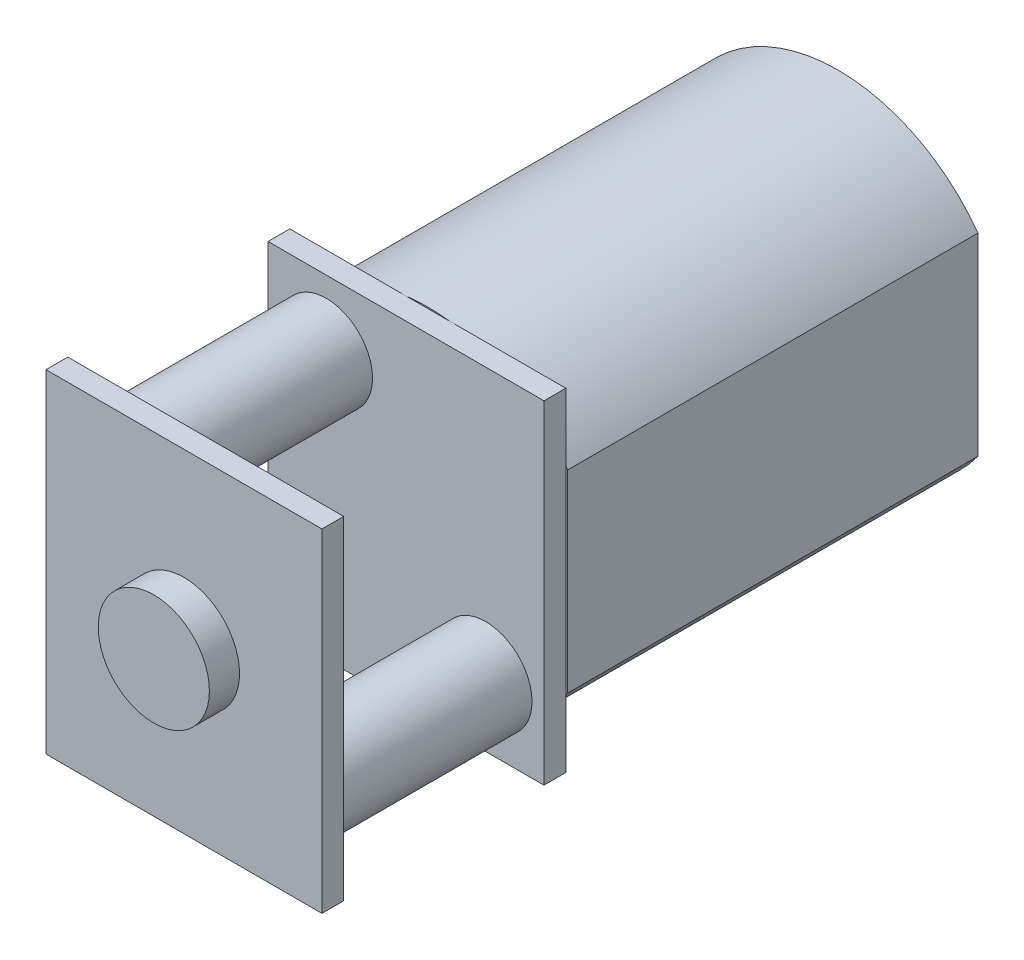
ISO-10303-21;
HEADER;
FILE_DESCRIPTION(('STEP AP214'),'2;1');
FILE_NAME('part.step','',(''),(''),'','','');
FILE_SCHEMA(('AUTOMOTIVE_DESIGN { 1 0 10303 214 1 1 1 1 }'));
ENDSEC;
DATA;
#1=APPLICATION_CONTEXT('core data for automotive mechanical design processes');
#2=APPLICATION_PROTOCOL_DEFINITION('international standard','automotive_design',2000,#1);
#3=PRODUCT_CONTEXT('',#1,'mechanical');
#4=PRODUCT('Part','Part','',(#3));
#5=PRODUCT_RELATED_PRODUCT_CATEGORY('part','',(#4));
#6=PRODUCT_DEFINITION_FORMATION('','',#4);
#7=PRODUCT_DEFINITION_CONTEXT('part definition',#1,'design');
#8=PRODUCT_DEFINITION('design','',#6,#7);
#9=PRODUCT_DEFINITION_SHAPE('','',#8);
#10=(LENGTH_UNIT() NAMED_UNIT(*) SI_UNIT(.MILLI.,.METRE.));
#11=(NAMED_UNIT(*) PLANE_ANGLE_UNIT() SI_UNIT($,.RADIAN.));
#12=(NAMED_UNIT(*) SI_UNIT($,.STERADIAN.) SOLID_ANGLE_UNIT());
#13=UNCERTAINTY_MEASURE_WITH_UNIT(LENGTH_MEASURE(1.E-05),#10,'distance_accuracy_value','');
#14=(GEOMETRIC_REPRESENTATION_CONTEXT(3) GLOBAL_UNCERTAINTY_ASSIGNED_CONTEXT((#13)) GLOBAL_UNIT_ASSIGNED_CONTEXT((#10,
#11,#12)) REPRESENTATION_CONTEXT('',''));
#15=CARTESIAN_POINT('',(0.,0.,0.));
#16=DIRECTION('',(0.,0.,1.));
#17=DIRECTION('',(1.,0.,0.));
#18=AXIS2_PLACEMENT_3D('',#15,#16,#17);
#19=CARTESIAN_POINT('',(9.94999999999999,9.42,23.42));
#20=DIRECTION('',(0.,0.,1.));
#21=DIRECTION('',(1.,0.,0.));
#22=AXIS2_PLACEMENT_3D('',#19,#20,#21);
#23=PLANE('',#22);
#24=DIRECTION('',(-1.,0.,0.));
#25=VECTOR('',#24,1.);
#26=CARTESIAN_POINT('',(0.0699999999999937,9.42,23.42));
#27=LINE('',#26,#25);
#28=CARTESIAN_POINT('',(9.94999999999999,9.42,23.42));
#29=VERTEX_POINT('',#28);
#30=CARTESIAN_POINT('',(0.0699999999999937,9.42,23.42));
#31=VERTEX_POINT('',#30);
#32=EDGE_CURVE('E158',#29,#31,#27,.T.);
#33=ORIENTED_EDGE('',*,*,#32,.T.);
#34=DIRECTION('',(0.,-1.,0.));
#35=VECTOR('',#34,1.);
#36=CARTESIAN_POINT('',(0.0699999999999937,-2.5,23.42));
#37=LINE('',#36,#35);
#38=CARTESIAN_POINT('',(0.0699999999999937,-2.5,23.42));
#39=VERTEX_POINT('',#38);
#40=EDGE_CURVE('E147',#31,#39,#37,.T.);
#41=ORIENTED_EDGE('',*,*,#40,.T.);
#42=DIRECTION('',(1.,0.,0.));
#43=VECTOR('',#42,1.);
#44=CARTESIAN_POINT('',(0.0699999999999937,-2.5,23.42));
#45=LINE('',#44,#43);
#46=CARTESIAN_POINT('',(9.94999999999999,-2.5,23.42));
#47=VERTEX_POINT('',#46);
#48=EDGE_CURVE('E157',#39,#47,#45,.T.);
#49=ORIENTED_EDGE('',*,*,#48,.T.);
#50=DIRECTION('',(0.,1.,0.));
#51=VECTOR('',#50,1.);
#52=CARTESIAN_POINT('',(9.94999999999999,-2.5,23.42));
#53=LINE('',#52,#51);
#54=EDGE_CURVE('E163',#47,#29,#53,.T.);
#55=ORIENTED_EDGE('',*,*,#54,.T.);
#56=EDGE_LOOP('',(#33,#41,#49,#55));
#57=FACE_BOUND('',#56,.T.);
#58=CARTESIAN_POINT('',(5.00999999999999,3.46,23.42));
#59=DIRECTION('',(0.,0.,1.));
#60=DIRECTION('',(1.,0.,0.));
#61=AXIS2_PLACEMENT_3D('',#58,#59,#60);
#62=CIRCLE('',#61,1.99);
#63=CARTESIAN_POINT('',(6.99999999999999,3.46,23.42));
#64=VERTEX_POINT('',#63);
#65=EDGE_CURVE('E387',#64,#64,#62,.T.);
#66=ORIENTED_EDGE('',*,*,#65,.F.);
#67=EDGE_LOOP('',(#66));
#68=FACE_BOUND('',#67,.T.);
#69=ADVANCED_FACE('F33',(#57,#68),#23,.T.);
#70=CARTESIAN_POINT('',(9.94999999999999,9.42,15.47));
#71=DIRECTION('',(0.,0.,-1.));
#72=DIRECTION('',(-1.,0.,0.));
#73=AXIS2_PLACEMENT_3D('',#70,#71,#72);
#74=PLANE('',#73);
#75=CARTESIAN_POINT('',(7.86499999999999,-0.125,15.47));
#76=DIRECTION('',(0.,0.,-1.));
#77=DIRECTION('',(-1.,0.,0.));
#78=AXIS2_PLACEMENT_3D('',#75,#76,#77);
#79=CIRCLE('',#78,1.655);
#80=CARTESIAN_POINT('',(6.20999999999999,-0.125,15.47));
#81=VERTEX_POINT('',#80);
#82=EDGE_CURVE('E41',#81,#81,#79,.F.);
#83=ORIENTED_EDGE('',*,*,#82,.F.);
#84=EDGE_LOOP('',(#83));
#85=FACE_BOUND('',#84,.T.);
#86=DIRECTION('',(0.,1.,0.));
#87=VECTOR('',#86,1.);
#88=CARTESIAN_POINT('',(9.94999999999999,-2.5,15.47));
#89=LINE('',#88,#87);
#90=CARTESIAN_POINT('',(9.94999999999999,-2.5,15.47));
#91=VERTEX_POINT('',#90);
#92=CARTESIAN_POINT('',(9.94999999999999,9.42,15.47));
#93=VERTEX_POINT('',#92);
#94=EDGE_CURVE('E184',#91,#93,#89,.T.);
#95=ORIENTED_EDGE('',*,*,#94,.T.);
#96=DIRECTION('',(-1.,0.,0.));
#97=VECTOR('',#96,1.);
#98=CARTESIAN_POINT('',(0.0699999999999937,9.42,15.47));
#99=LINE('',#98,#97);
#100=CARTESIAN_POINT('',(0.0699999999999937,9.42,15.47));
#101=VERTEX_POINT('',#100);
#102=EDGE_CURVE('E187',#93,#101,#99,.T.);
#103=ORIENTED_EDGE('',*,*,#102,.T.);
#104=DIRECTION('',(0.,-1.,0.));
#105=VECTOR('',#104,1.);
#106=CARTESIAN_POINT('',(0.0699999999999937,-2.5,15.47));
#107=LINE('',#106,#105);
#108=CARTESIAN_POINT('',(0.0699999999999937,-2.5,15.47));
#109=VERTEX_POINT('',#108);
#110=EDGE_CURVE('E190',#101,#109,#107,.T.);
#111=ORIENTED_EDGE('',*,*,#110,.T.);
#112=DIRECTION('',(1.,0.,0.));
#113=VECTOR('',#112,1.);
#114=CARTESIAN_POINT('',(0.0699999999999937,-2.5,15.47));
#115=LINE('',#114,#113);
#116=EDGE_CURVE('E192',#109,#91,#115,.T.);
#117=ORIENTED_EDGE('',*,*,#116,.T.);
#118=EDGE_LOOP('',(#95,#103,#111,#117));
#119=FACE_BOUND('',#118,.T.);
#120=CARTESIAN_POINT('',(2.15499999999999,7.045,15.47));
#121=DIRECTION('',(0.,0.,-1.));
#122=DIRECTION('',(-1.,0.,0.));
#123=AXIS2_PLACEMENT_3D('',#120,#121,#122);
#124=CIRCLE('',#123,1.655);
#125=CARTESIAN_POINT('',(0.499999999999994,7.045,15.47));
#126=VERTEX_POINT('',#125);
#127=EDGE_CURVE('E11',#126,#126,#124,.F.);
#128=ORIENTED_EDGE('',*,*,#127,.F.);
#129=EDGE_LOOP('',(#128));
#130=FACE_BOUND('',#129,.T.);
#131=ADVANCED_FACE('F274',(#85,#119,#130),#74,.F.);
#132=CARTESIAN_POINT('',(5.01,3.64658823529411,14.69));
#133=DIRECTION('',(0.,0.,1.));
#134=DIRECTION('',(1.,0.,0.));
#135=AXIS2_PLACEMENT_3D('',#132,#133,#134);
#136=PLANE('',#135);
#137=DIRECTION('',(0.,1.,0.));
#138=VECTOR('',#137,1.);
#139=CARTESIAN_POINT('',(9.94999999999999,-2.5,14.69));
#140=LINE('',#139,#138);
#141=CARTESIAN_POINT('',(9.94999999999999,-0.0942814173114778,14.69));
#142=VERTEX_POINT('',#141);
#143=CARTESIAN_POINT('',(9.94999999999999,7.01428141731148,14.69));
#144=VERTEX_POINT('',#143);
#145=EDGE_CURVE('E199',#142,#144,#140,.T.);
#146=ORIENTED_EDGE('',*,*,#145,.F.);
#147=CARTESIAN_POINT('',(5.01,3.64658823529411,14.69));
#148=DIRECTION('',(0.,0.,1.));
#149=DIRECTION('',(1.,0.,0.));
#150=AXIS2_PLACEMENT_3D('',#147,#148,#149);
#151=CIRCLE('',#150,6.19658823529412);
#152=CARTESIAN_POINT('',(10.02,0.,14.69));
#153=VERTEX_POINT('',#152);
#154=EDGE_CURVE('E227',#142,#153,#151,.T.);
#155=ORIENTED_EDGE('',*,*,#154,.T.);
#156=DIRECTION('',(0.,1.,0.));
#157=VECTOR('',#156,1.);
#158=CARTESIAN_POINT('',(10.02,0.,14.69));
#159=LINE('',#158,#157);
#160=CARTESIAN_POINT('',(10.02,6.92,14.69));
#161=VERTEX_POINT('',#160);
#162=EDGE_CURVE('E225',#153,#161,#159,.T.);
#163=ORIENTED_EDGE('',*,*,#162,.T.);
#164=CARTESIAN_POINT('',(5.01,3.27341176470589,14.69));
#165=DIRECTION('',(0.,0.,1.));
#166=DIRECTION('',(-1.,0.,0.));
#167=AXIS2_PLACEMENT_3D('',#164,#165,#166);
#168=CIRCLE('',#167,6.19658823529411);
#169=EDGE_CURVE('E230',#161,#144,#168,.T.);
#170=ORIENTED_EDGE('',*,*,#169,.T.);
#171=EDGE_LOOP('',(#146,#155,#163,#170));
#172=FACE_BOUND('',#171,.T.);
#173=ADVANCED_FACE('F292',(#172),#136,.T.);
#174=DIRECTION('',(1.,0.,0.));
#175=VECTOR('',#174,1.);
#176=CARTESIAN_POINT('',(0.0699999999999937,-2.5,14.69));
#177=LINE('',#176,#175);
#178=CARTESIAN_POINT('',(4.22440543310852,-2.5,14.69));
#179=VERTEX_POINT('',#178);
#180=CARTESIAN_POINT('',(5.79559456689147,-2.5,14.69));
#181=VERTEX_POINT('',#180);
#182=EDGE_CURVE('E210',#179,#181,#177,.T.);
#183=ORIENTED_EDGE('',*,*,#182,.F.);
#184=EDGE_CURVE('E289',#179,#181,#151,.T.);
#185=ORIENTED_EDGE('',*,*,#184,.T.);
#186=EDGE_LOOP('',(#183,#185));
#187=FACE_BOUND('',#186,.T.);
#188=ADVANCED_FACE('F559',(#187),#136,.T.);
#189=DIRECTION('',(0.,-1.,0.));
#190=VECTOR('',#189,1.);
#191=CARTESIAN_POINT('',(0.0699999999999937,-2.5,14.69));
#192=LINE('',#191,#190);
#193=CARTESIAN_POINT('',(0.0699999999999937,7.01428141731146,14.69));
#194=VERTEX_POINT('',#193);
#195=CARTESIAN_POINT('',(0.0699999999999937,-0.0942814173114639,14.69));
#196=VERTEX_POINT('',#195);
#197=EDGE_CURVE('E48',#194,#196,#192,.T.);
#198=ORIENTED_EDGE('',*,*,#197,.F.);
#199=CARTESIAN_POINT('',(0.,6.92,14.69));
#200=VERTEX_POINT('',#199);
#201=EDGE_CURVE('E229',#194,#200,#168,.T.);
#202=ORIENTED_EDGE('',*,*,#201,.T.);
#203=DIRECTION('',(0.,-1.,0.));
#204=VECTOR('',#203,1.);
#205=CARTESIAN_POINT('',(0.,0.,14.69));
#206=LINE('',#205,#204);
#207=CARTESIAN_POINT('',(0.,0.,14.69));
#208=VERTEX_POINT('',#207);
#209=EDGE_CURVE('E233',#200,#208,#206,.T.);
#210=ORIENTED_EDGE('',*,*,#209,.T.);
#211=EDGE_CURVE('E223',#208,#196,#151,.T.);
#212=ORIENTED_EDGE('',*,*,#211,.T.);
#213=EDGE_LOOP('',(#198,#202,#210,#212));
#214=FACE_BOUND('',#213,.T.);
#215=ADVANCED_FACE('F315',(#214),#136,.T.);
#216=CARTESIAN_POINT('',(5.01,3.64658823529411,14.69));
#217=DIRECTION('',(0.,0.,-1.));
#218=DIRECTION('',(-1.,0.,0.));
#219=AXIS2_PLACEMENT_3D('',#216,#217,#218);
#220=CYLINDRICAL_SURFACE('',#219,6.19658823529412);
#221=CARTESIAN_POINT('',(5.01,3.64658823529411,0.));
#222=DIRECTION('',(0.,0.,1.));
#223=DIRECTION('',(1.,0.,0.));
#224=AXIS2_PLACEMENT_3D('',#221,#222,#223);
#225=CIRCLE('',#224,6.19658823529412);
#226=CARTESIAN_POINT('',(0.,0.,0.));
#227=VERTEX_POINT('',#226);
#228=CARTESIAN_POINT('',(10.02,0.,0.));
#229=VERTEX_POINT('',#228);
#230=EDGE_CURVE('E222',#227,#229,#225,.T.);
#231=ORIENTED_EDGE('',*,*,#230,.T.);
#232=DIRECTION('',(0.,0.,-1.));
#233=VECTOR('',#232,1.);
#234=CARTESIAN_POINT('',(10.02,0.,14.69));
#235=LINE('',#234,#233);
#236=EDGE_CURVE('E253',#153,#229,#235,.T.);
#237=ORIENTED_EDGE('',*,*,#236,.F.);
#238=ORIENTED_EDGE('',*,*,#154,.F.);
#239=EDGE_CURVE('E284',#181,#142,#151,.T.);
#240=ORIENTED_EDGE('',*,*,#239,.F.);
#241=ORIENTED_EDGE('',*,*,#184,.F.);
#242=EDGE_CURVE('E226',#196,#179,#151,.T.);
#243=ORIENTED_EDGE('',*,*,#242,.F.);
#244=ORIENTED_EDGE('',*,*,#211,.F.);
#245=DIRECTION('',(0.,0.,-1.));
#246=VECTOR('',#245,1.);
#247=CARTESIAN_POINT('',(0.,0.,14.69));
#248=LINE('',#247,#246);
#249=EDGE_CURVE('E236',#208,#227,#248,.T.);
#250=ORIENTED_EDGE('',*,*,#249,.T.);
#251=EDGE_LOOP('',(#231,#237,#238,#240,#241,#243,#244,#250));
#252=FACE_BOUND('',#251,.T.);
#253=ADVANCED_FACE('F35',(#252),#220,.T.);
#254=CARTESIAN_POINT('',(10.02,0.,14.69));
#255=DIRECTION('',(-1.,0.,0.));
#256=DIRECTION('',(0.,-1.,0.));
#257=AXIS2_PLACEMENT_3D('',#254,#255,#256);
#258=PLANE('',#257);
#259=DIRECTION('',(0.,1.,0.));
#260=VECTOR('',#259,1.);
#261=CARTESIAN_POINT('',(10.02,0.,0.));
#262=LINE('',#261,#260);
#263=CARTESIAN_POINT('',(10.02,6.92,0.));
#264=VERTEX_POINT('',#263);
#265=EDGE_CURVE('E239',#229,#264,#262,.T.);
#266=ORIENTED_EDGE('',*,*,#265,.T.);
#267=DIRECTION('',(0.,0.,-1.));
#268=VECTOR('',#267,1.);
#269=CARTESIAN_POINT('',(10.02,6.92,14.69));
#270=LINE('',#269,#268);
#271=EDGE_CURVE('E250',#161,#264,#270,.T.);
#272=ORIENTED_EDGE('',*,*,#271,.F.);
#273=ORIENTED_EDGE('',*,*,#162,.F.);
#274=ORIENTED_EDGE('',*,*,#236,.T.);
#275=EDGE_LOOP('',(#266,#272,#273,#274));
#276=FACE_BOUND('',#275,.T.);
#277=ADVANCED_FACE('F296',(#276),#258,.F.);
#278=CARTESIAN_POINT('',(5.01,3.27341176470589,14.69));
#279=DIRECTION('',(0.,0.,-1.));
#280=DIRECTION('',(-1.,0.,0.));
#281=AXIS2_PLACEMENT_3D('',#278,#279,#280);
#282=CYLINDRICAL_SURFACE('',#281,6.19658823529411);
#283=CARTESIAN_POINT('',(5.01,3.27341176470589,0.));
#284=DIRECTION('',(0.,0.,1.));
#285=DIRECTION('',(-1.,0.,0.));
#286=AXIS2_PLACEMENT_3D('',#283,#284,#285);
#287=CIRCLE('',#286,6.19658823529411);
#288=CARTESIAN_POINT('',(0.,6.92,0.));
#289=VERTEX_POINT('',#288);
#290=EDGE_CURVE('E241',#264,#289,#287,.T.);
#291=ORIENTED_EDGE('',*,*,#290,.T.);
#292=DIRECTION('',(0.,0.,-1.));
#293=VECTOR('',#292,1.);
#294=CARTESIAN_POINT('',(0.,6.92,14.69));
#295=LINE('',#294,#293);
#296=EDGE_CURVE('E247',#200,#289,#295,.T.);
#297=ORIENTED_EDGE('',*,*,#296,.F.);
#298=ORIENTED_EDGE('',*,*,#201,.F.);
#299=CARTESIAN_POINT('',(4.22440543310852,9.42,14.69));
#300=VERTEX_POINT('',#299);
#301=EDGE_CURVE('E310',#300,#194,#168,.T.);
#302=ORIENTED_EDGE('',*,*,#301,.F.);
#303=CARTESIAN_POINT('',(5.79559456689147,9.42,14.69));
#304=VERTEX_POINT('',#303);
#305=EDGE_CURVE('E309',#304,#300,#168,.T.);
#306=ORIENTED_EDGE('',*,*,#305,.F.);
#307=EDGE_CURVE('E234',#144,#304,#168,.T.);
#308=ORIENTED_EDGE('',*,*,#307,.F.);
#309=ORIENTED_EDGE('',*,*,#169,.F.);
#310=ORIENTED_EDGE('',*,*,#271,.T.);
#311=EDGE_LOOP('',(#291,#297,#298,#302,#306,#308,#309,#310));
#312=FACE_BOUND('',#311,.T.);
#313=ADVANCED_FACE('F306',(#312),#282,.T.);
#314=CARTESIAN_POINT('',(0.,0.,14.69));
#315=DIRECTION('',(1.,0.,0.));
#316=DIRECTION('',(0.,0.,-1.));
#317=AXIS2_PLACEMENT_3D('',#314,#315,#316);
#318=PLANE('',#317);
#319=DIRECTION('',(0.,-1.,0.));
#320=VECTOR('',#319,1.);
#321=CARTESIAN_POINT('',(0.,0.,0.));
#322=LINE('',#321,#320);
#323=EDGE_CURVE('E243',#289,#227,#322,.T.);
#324=ORIENTED_EDGE('',*,*,#323,.T.);
#325=ORIENTED_EDGE('',*,*,#249,.F.);
#326=ORIENTED_EDGE('',*,*,#209,.F.);
#327=ORIENTED_EDGE('',*,*,#296,.T.);
#328=EDGE_LOOP('',(#324,#325,#326,#327));
#329=FACE_BOUND('',#328,.T.);
#330=ADVANCED_FACE('F318',(#329),#318,.F.);
#331=DIRECTION('',(-1.,0.,0.));
#332=VECTOR('',#331,1.);
#333=CARTESIAN_POINT('',(0.0699999999999937,9.42,14.69));
#334=LINE('',#333,#332);
#335=EDGE_CURVE('E55',#304,#300,#334,.T.);
#336=ORIENTED_EDGE('',*,*,#335,.F.);
#337=ORIENTED_EDGE('',*,*,#305,.T.);
#338=EDGE_LOOP('',(#336,#337));
#339=FACE_BOUND('',#338,.T.);
#340=ADVANCED_FACE('F526',(#339),#136,.T.);
#341=CARTESIAN_POINT('',(5.01,3.64658823529411,0.));
#342=DIRECTION('',(0.,0.,1.));
#343=DIRECTION('',(1.,0.,0.));
#344=AXIS2_PLACEMENT_3D('',#341,#342,#343);
#345=PLANE('',#344);
#346=ORIENTED_EDGE('',*,*,#230,.F.);
#347=ORIENTED_EDGE('',*,*,#323,.F.);
#348=ORIENTED_EDGE('',*,*,#290,.F.);
#349=ORIENTED_EDGE('',*,*,#265,.F.);
#350=EDGE_LOOP('',(#346,#347,#348,#349));
#351=FACE_BOUND('',#350,.T.);
#352=ADVANCED_FACE('F303',(#351),#345,.F.);
#353=CARTESIAN_POINT('',(9.94999999999999,9.42,14.69));
#354=DIRECTION('',(0.,0.,-1.));
#355=DIRECTION('',(-1.,0.,0.));
#356=AXIS2_PLACEMENT_3D('',#353,#354,#355);
#357=PLANE('',#356);
#358=CARTESIAN_POINT('',(0.0699999999999937,-2.5,14.69));
#359=VERTEX_POINT('',#358);
#360=EDGE_CURVE('E203',#196,#359,#192,.T.);
#361=ORIENTED_EDGE('',*,*,#360,.F.);
#362=ORIENTED_EDGE('',*,*,#242,.T.);
#363=EDGE_CURVE('E188',#359,#179,#177,.T.);
#364=ORIENTED_EDGE('',*,*,#363,.F.);
#365=EDGE_LOOP('',(#361,#362,#364));
#366=FACE_BOUND('',#365,.T.);
#367=ADVANCED_FACE('F323',(#366),#357,.T.);
#368=CARTESIAN_POINT('',(9.94999999999999,-2.5,14.69));
#369=VERTEX_POINT('',#368);
#370=EDGE_CURVE('E207',#181,#369,#177,.T.);
#371=ORIENTED_EDGE('',*,*,#370,.F.);
#372=ORIENTED_EDGE('',*,*,#239,.T.);
#373=EDGE_CURVE('E195',#369,#142,#140,.T.);
#374=ORIENTED_EDGE('',*,*,#373,.F.);
#375=EDGE_LOOP('',(#371,#372,#374));
#376=FACE_BOUND('',#375,.T.);
#377=ADVANCED_FACE('F283',(#376),#357,.T.);
#378=CARTESIAN_POINT('',(9.94999999999999,9.42,14.69));
#379=VERTEX_POINT('',#378);
#380=EDGE_CURVE('E183',#144,#379,#140,.T.);
#381=ORIENTED_EDGE('',*,*,#380,.F.);
#382=ORIENTED_EDGE('',*,*,#307,.T.);
#383=EDGE_CURVE('E200',#379,#304,#334,.T.);
#384=ORIENTED_EDGE('',*,*,#383,.F.);
#385=EDGE_LOOP('',(#381,#382,#384));
#386=FACE_BOUND('',#385,.T.);
#387=ADVANCED_FACE('F268',(#386),#357,.T.);
#388=CARTESIAN_POINT('',(9.94999999999999,-2.5,15.47));
#389=DIRECTION('',(-1.,0.,0.));
#390=DIRECTION('',(0.,0.,1.));
#391=AXIS2_PLACEMENT_3D('',#388,#389,#390);
#392=PLANE('',#391);
#393=ORIENTED_EDGE('',*,*,#373,.T.);
#394=ORIENTED_EDGE('',*,*,#145,.T.);
#395=ORIENTED_EDGE('',*,*,#380,.T.);
#396=DIRECTION('',(0.,0.,-1.));
#397=VECTOR('',#396,1.);
#398=CARTESIAN_POINT('',(9.94999999999999,9.42,15.47));
#399=LINE('',#398,#397);
#400=EDGE_CURVE('E219',#93,#379,#399,.T.);
#401=ORIENTED_EDGE('',*,*,#400,.F.);
#402=ORIENTED_EDGE('',*,*,#94,.F.);
#403=DIRECTION('',(0.,0.,-1.));
#404=VECTOR('',#403,1.);
#405=CARTESIAN_POINT('',(9.94999999999999,-2.5,15.47));
#406=LINE('',#405,#404);
#407=EDGE_CURVE('E194',#91,#369,#406,.T.);
#408=ORIENTED_EDGE('',*,*,#407,.T.);
#409=EDGE_LOOP('',(#393,#394,#395,#401,#402,#408));
#410=FACE_BOUND('',#409,.T.);
#411=ADVANCED_FACE('F264',(#410),#392,.F.);
#412=CARTESIAN_POINT('',(0.0699999999999937,9.42,15.47));
#413=DIRECTION('',(0.,-1.,0.));
#414=DIRECTION('',(0.,0.,-1.));
#415=AXIS2_PLACEMENT_3D('',#412,#413,#414);
#416=PLANE('',#415);
#417=ORIENTED_EDGE('',*,*,#383,.T.);
#418=ORIENTED_EDGE('',*,*,#335,.T.);
#419=CARTESIAN_POINT('',(0.0699999999999937,9.42,14.69));
#420=VERTEX_POINT('',#419);
#421=EDGE_CURVE('E198',#300,#420,#334,.T.);
#422=ORIENTED_EDGE('',*,*,#421,.T.);
#423=DIRECTION('',(0.,0.,-1.));
#424=VECTOR('',#423,1.);
#425=CARTESIAN_POINT('',(0.0699999999999937,9.42,15.47));
#426=LINE('',#425,#424);
#427=EDGE_CURVE('E216',#101,#420,#426,.T.);
#428=ORIENTED_EDGE('',*,*,#427,.F.);
#429=ORIENTED_EDGE('',*,*,#102,.F.);
#430=ORIENTED_EDGE('',*,*,#400,.T.);
#431=EDGE_LOOP('',(#417,#418,#422,#428,#429,#430));
#432=FACE_BOUND('',#431,.T.);
#433=ADVANCED_FACE('F270',(#432),#416,.F.);
#434=CARTESIAN_POINT('',(0.0699999999999937,-2.5,15.47));
#435=DIRECTION('',(1.,0.,0.));
#436=DIRECTION('',(0.,0.,-1.));
#437=AXIS2_PLACEMENT_3D('',#434,#435,#436);
#438=PLANE('',#437);
#439=EDGE_CURVE('E204',#420,#194,#192,.T.);
#440=ORIENTED_EDGE('',*,*,#439,.T.);
#441=ORIENTED_EDGE('',*,*,#197,.T.);
#442=ORIENTED_EDGE('',*,*,#360,.T.);
#443=DIRECTION('',(0.,0.,-1.));
#444=VECTOR('',#443,1.);
#445=CARTESIAN_POINT('',(0.0699999999999937,-2.5,15.47));
#446=LINE('',#445,#444);
#447=EDGE_CURVE('E213',#109,#359,#446,.T.);
#448=ORIENTED_EDGE('',*,*,#447,.F.);
#449=ORIENTED_EDGE('',*,*,#110,.F.);
#450=ORIENTED_EDGE('',*,*,#427,.T.);
#451=EDGE_LOOP('',(#440,#441,#442,#448,#449,#450));
#452=FACE_BOUND('',#451,.T.);
#453=ADVANCED_FACE('F326',(#452),#438,.F.);
#454=CARTESIAN_POINT('',(0.0699999999999937,-2.5,15.47));
#455=DIRECTION('',(0.,1.,0.));
#456=DIRECTION('',(0.,0.,1.));
#457=AXIS2_PLACEMENT_3D('',#454,#455,#456);
#458=PLANE('',#457);
#459=ORIENTED_EDGE('',*,*,#363,.T.);
#460=ORIENTED_EDGE('',*,*,#182,.T.);
#461=ORIENTED_EDGE('',*,*,#370,.T.);
#462=ORIENTED_EDGE('',*,*,#407,.F.);
#463=ORIENTED_EDGE('',*,*,#116,.F.);
#464=ORIENTED_EDGE('',*,*,#447,.T.);
#465=EDGE_LOOP('',(#459,#460,#461,#462,#463,#464));
#466=FACE_BOUND('',#465,.T.);
#467=ADVANCED_FACE('F330',(#466),#458,.F.);
#468=ORIENTED_EDGE('',*,*,#421,.F.);
#469=ORIENTED_EDGE('',*,*,#301,.T.);
#470=ORIENTED_EDGE('',*,*,#439,.F.);
#471=EDGE_LOOP('',(#468,#469,#470));
#472=FACE_BOUND('',#471,.T.);
#473=ADVANCED_FACE('F327',(#472),#357,.T.);
#474=CARTESIAN_POINT('',(7.86499999999999,-0.125,22.64));
#475=DIRECTION('',(0.,0.,-1.));
#476=DIRECTION('',(-1.,0.,0.));
#477=AXIS2_PLACEMENT_3D('',#474,#475,#476);
#478=CYLINDRICAL_SURFACE('',#477,1.655);
#479=CARTESIAN_POINT('',(7.86499999999999,-0.125,22.64));
#480=DIRECTION('',(0.,0.,1.));
#481=DIRECTION('',(1.,0.,0.));
#482=AXIS2_PLACEMENT_3D('',#479,#480,#481);
#483=CIRCLE('',#482,1.655);
#484=CARTESIAN_POINT('',(9.51999999999999,-0.125,22.64));
#485=VERTEX_POINT('',#484);
#486=EDGE_CURVE('E175',#485,#485,#483,.T.);
#487=ORIENTED_EDGE('',*,*,#486,.F.);
#488=EDGE_LOOP('',(#487));
#489=FACE_BOUND('',#488,.T.);
#490=ORIENTED_EDGE('',*,*,#82,.T.);
#491=EDGE_LOOP('',(#490));
#492=FACE_BOUND('',#491,.T.);
#493=ADVANCED_FACE('F329',(#489,#492),#478,.T.);
#494=CARTESIAN_POINT('',(2.15499999999999,7.045,22.64));
#495=DIRECTION('',(0.,0.,-1.));
#496=DIRECTION('',(-1.,0.,0.));
#497=AXIS2_PLACEMENT_3D('',#494,#495,#496);
#498=CYLINDRICAL_SURFACE('',#497,1.655);
#499=CARTESIAN_POINT('',(2.15499999999999,7.045,22.64));
#500=DIRECTION('',(0.,0.,1.));
#501=DIRECTION('',(1.,0.,0.));
#502=AXIS2_PLACEMENT_3D('',#499,#500,#501);
#503=CIRCLE('',#502,1.655);
#504=CARTESIAN_POINT('',(3.80999999999999,7.045,22.64));
#505=VERTEX_POINT('',#504);
#506=EDGE_CURVE('E172',#505,#505,#503,.T.);
#507=ORIENTED_EDGE('',*,*,#506,.F.);
#508=EDGE_LOOP('',(#507));
#509=FACE_BOUND('',#508,.T.);
#510=ORIENTED_EDGE('',*,*,#127,.T.);
#511=EDGE_LOOP('',(#510));
#512=FACE_BOUND('',#511,.T.);
#513=ADVANCED_FACE('F336',(#509,#512),#498,.T.);
#514=CARTESIAN_POINT('',(9.94999999999999,9.42,22.64));
#515=DIRECTION('',(0.,0.,1.));
#516=DIRECTION('',(1.,0.,0.));
#517=AXIS2_PLACEMENT_3D('',#514,#515,#516);
#518=PLANE('',#517);
#519=ORIENTED_EDGE('',*,*,#506,.T.);
#520=EDGE_LOOP('',(#519));
#521=FACE_BOUND('',#520,.T.);
#522=DIRECTION('',(-1.,0.,0.));
#523=VECTOR('',#522,1.);
#524=CARTESIAN_POINT('',(0.0699999999999937,9.42,22.64));
#525=LINE('',#524,#523);
#526=CARTESIAN_POINT('',(9.94999999999999,9.42,22.64));
#527=VERTEX_POINT('',#526);
#528=CARTESIAN_POINT('',(0.0699999999999937,9.42,22.64));
#529=VERTEX_POINT('',#528);
#530=EDGE_CURVE('E171',#527,#529,#525,.T.);
#531=ORIENTED_EDGE('',*,*,#530,.F.);
#532=DIRECTION('',(0.,1.,0.));
#533=VECTOR('',#532,1.);
#534=CARTESIAN_POINT('',(9.94999999999999,-2.5,22.64));
#535=LINE('',#534,#533);
#536=CARTESIAN_POINT('',(9.94999999999999,-2.5,22.64));
#537=VERTEX_POINT('',#536);
#538=EDGE_CURVE('E167',#537,#527,#535,.T.);
#539=ORIENTED_EDGE('',*,*,#538,.F.);
#540=DIRECTION('',(1.,0.,0.));
#541=VECTOR('',#540,1.);
#542=CARTESIAN_POINT('',(0.0699999999999937,-2.5,22.64));
#543=LINE('',#542,#541);
#544=CARTESIAN_POINT('',(0.0699999999999937,-2.5,22.64));
#545=VERTEX_POINT('',#544);
#546=EDGE_CURVE('E384',#545,#537,#543,.T.);
#547=ORIENTED_EDGE('',*,*,#546,.F.);
#548=DIRECTION('',(0.,-1.,0.));
#549=VECTOR('',#548,1.);
#550=CARTESIAN_POINT('',(0.0699999999999937,-2.5,22.64));
#551=LINE('',#550,#549);
#552=EDGE_CURVE('E381',#529,#545,#551,.T.);
#553=ORIENTED_EDGE('',*,*,#552,.F.);
#554=EDGE_LOOP('',(#531,#539,#547,#553));
#555=FACE_BOUND('',#554,.T.);
#556=ORIENTED_EDGE('',*,*,#486,.T.);
#557=EDGE_LOOP('',(#556));
#558=FACE_BOUND('',#557,.T.);
#559=ADVANCED_FACE('F353',(#521,#555,#558),#518,.F.);
#560=CARTESIAN_POINT('',(0.0699999999999937,9.42,23.42));
#561=DIRECTION('',(0.,-1.,0.));
#562=DIRECTION('',(0.,0.,-1.));
#563=AXIS2_PLACEMENT_3D('',#560,#561,#562);
#564=PLANE('',#563);
#565=ORIENTED_EDGE('',*,*,#530,.T.);
#566=DIRECTION('',(0.,0.,-1.));
#567=VECTOR('',#566,1.);
#568=CARTESIAN_POINT('',(0.0699999999999937,9.42,23.42));
#569=LINE('',#568,#567);
#570=EDGE_CURVE('E151',#31,#529,#569,.T.);
#571=ORIENTED_EDGE('',*,*,#570,.F.);
#572=ORIENTED_EDGE('',*,*,#32,.F.);
#573=DIRECTION('',(0.,0.,-1.));
#574=VECTOR('',#573,1.);
#575=CARTESIAN_POINT('',(9.94999999999999,9.42,23.42));
#576=LINE('',#575,#574);
#577=EDGE_CURVE('E394',#29,#527,#576,.T.);
#578=ORIENTED_EDGE('',*,*,#577,.T.);
#579=EDGE_LOOP('',(#565,#571,#572,#578));
#580=FACE_BOUND('',#579,.T.);
#581=ADVANCED_FACE('F169',(#580),#564,.F.);
#582=CARTESIAN_POINT('',(0.0699999999999937,-2.5,23.42));
#583=DIRECTION('',(1.,0.,0.));
#584=DIRECTION('',(0.,0.,-1.));
#585=AXIS2_PLACEMENT_3D('',#582,#583,#584);
#586=PLANE('',#585);
#587=ORIENTED_EDGE('',*,*,#552,.T.);
#588=DIRECTION('',(0.,0.,-1.));
#589=VECTOR('',#588,1.);
#590=CARTESIAN_POINT('',(0.0699999999999937,-2.5,23.42));
#591=LINE('',#590,#589);
#592=EDGE_CURVE('E154',#39,#545,#591,.T.);
#593=ORIENTED_EDGE('',*,*,#592,.F.);
#594=ORIENTED_EDGE('',*,*,#40,.F.);
#595=ORIENTED_EDGE('',*,*,#570,.T.);
#596=EDGE_LOOP('',(#587,#593,#594,#595));
#597=FACE_BOUND('',#596,.T.);
#598=ADVANCED_FACE('F149',(#597),#586,.F.);
#599=CARTESIAN_POINT('',(0.0699999999999937,-2.5,23.42));
#600=DIRECTION('',(0.,1.,0.));
#601=DIRECTION('',(0.,0.,1.));
#602=AXIS2_PLACEMENT_3D('',#599,#600,#601);
#603=PLANE('',#602);
#604=ORIENTED_EDGE('',*,*,#546,.T.);
#605=DIRECTION('',(0.,0.,-1.));
#606=VECTOR('',#605,1.);
#607=CARTESIAN_POINT('',(9.94999999999999,-2.5,23.42));
#608=LINE('',#607,#606);
#609=EDGE_CURVE('E177',#47,#537,#608,.T.);
#610=ORIENTED_EDGE('',*,*,#609,.F.);
#611=ORIENTED_EDGE('',*,*,#48,.F.);
#612=ORIENTED_EDGE('',*,*,#592,.T.);
#613=EDGE_LOOP('',(#604,#610,#611,#612));
#614=FACE_BOUND('',#613,.T.);
#615=ADVANCED_FACE('F360',(#614),#603,.F.);
#616=CARTESIAN_POINT('',(9.94999999999999,-2.5,23.42));
#617=DIRECTION('',(-1.,0.,0.));
#618=DIRECTION('',(0.,0.,1.));
#619=AXIS2_PLACEMENT_3D('',#616,#617,#618);
#620=PLANE('',#619);
#621=ORIENTED_EDGE('',*,*,#538,.T.);
#622=ORIENTED_EDGE('',*,*,#577,.F.);
#623=ORIENTED_EDGE('',*,*,#54,.F.);
#624=ORIENTED_EDGE('',*,*,#609,.T.);
#625=EDGE_LOOP('',(#621,#622,#623,#624));
#626=FACE_BOUND('',#625,.T.);
#627=ADVANCED_FACE('F357',(#626),#620,.F.);
#628=CARTESIAN_POINT('',(5.00999999999999,3.46,24.5));
#629=DIRECTION('',(0.,0.,-1.));
#630=DIRECTION('',(-1.,0.,0.));
#631=AXIS2_PLACEMENT_3D('',#628,#629,#630);
#632=CYLINDRICAL_SURFACE('',#631,1.99);
#633=CARTESIAN_POINT('',(5.00999999999999,3.46,24.5));
#634=DIRECTION('',(0.,0.,1.));
#635=DIRECTION('',(1.,0.,0.));
#636=AXIS2_PLACEMENT_3D('',#633,#634,#635);
#637=CIRCLE('',#636,1.99);
#638=CARTESIAN_POINT('',(6.99999999999999,3.46,24.5));
#639=VERTEX_POINT('',#638);
#640=EDGE_CURVE('E382',#639,#639,#637,.T.);
#641=ORIENTED_EDGE('',*,*,#640,.F.);
#642=EDGE_LOOP('',(#641));
#643=FACE_BOUND('',#642,.T.);
#644=ORIENTED_EDGE('',*,*,#65,.T.);
#645=EDGE_LOOP('',(#644));
#646=FACE_BOUND('',#645,.T.);
#647=ADVANCED_FACE('F351',(#643,#646),#632,.T.);
#648=CARTESIAN_POINT('',(5.00999999999999,3.46,24.5));
#649=DIRECTION('',(0.,0.,1.));
#650=DIRECTION('',(1.,0.,0.));
#651=AXIS2_PLACEMENT_3D('',#648,#649,#650);
#652=PLANE('',#651);
#653=ORIENTED_EDGE('',*,*,#640,.T.);
#654=EDGE_LOOP('',(#653));
#655=FACE_BOUND('',#654,.T.);
#656=ADVANCED_FACE('F402',(#655),#652,.T.);
#657=CLOSED_SHELL('',(#69,#131,#173,#188,#215,#253,#277,#313,#330,#340,#352,#367,#377,#387,#411,
#433,#453,#467,#473,#493,#513,#559,#581,#598,#615,#627,#647,#656));
#658=MANIFOLD_SOLID_BREP('B2',#657);
#659=ADVANCED_BREP_SHAPE_REPRESENTATION('',(#18,#658),#14);
#660=SHAPE_DEFINITION_REPRESENTATION(#9,#659);
ENDSEC;
END-ISO-10303-21;
